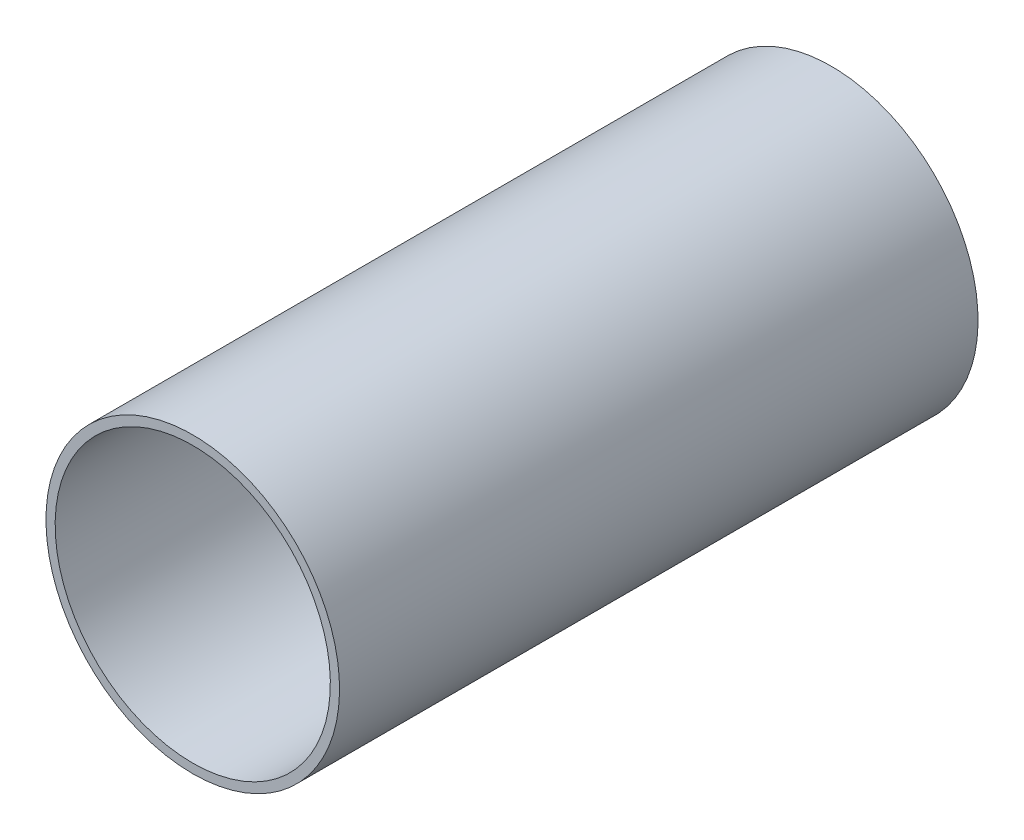
ISO-10303-21;
HEADER;
FILE_DESCRIPTION(('STEP AP214'),'2;1');
FILE_NAME('part.step','',(''),(''),'','','');
FILE_SCHEMA(('AUTOMOTIVE_DESIGN { 1 0 10303 214 1 1 1 1 }'));
ENDSEC;
DATA;
#1=APPLICATION_CONTEXT('core data for automotive mechanical design processes');
#2=APPLICATION_PROTOCOL_DEFINITION('international standard','automotive_design',2000,#1);
#3=PRODUCT_CONTEXT('',#1,'mechanical');
#4=PRODUCT('Part','Part','',(#3));
#5=PRODUCT_RELATED_PRODUCT_CATEGORY('part','',(#4));
#6=PRODUCT_DEFINITION_FORMATION('','',#4);
#7=PRODUCT_DEFINITION_CONTEXT('part definition',#1,'design');
#8=PRODUCT_DEFINITION('design','',#6,#7);
#9=PRODUCT_DEFINITION_SHAPE('','',#8);
#10=(LENGTH_UNIT() NAMED_UNIT(*) SI_UNIT(.MILLI.,.METRE.));
#11=(NAMED_UNIT(*) PLANE_ANGLE_UNIT() SI_UNIT($,.RADIAN.));
#12=(NAMED_UNIT(*) SI_UNIT($,.STERADIAN.) SOLID_ANGLE_UNIT());
#13=UNCERTAINTY_MEASURE_WITH_UNIT(LENGTH_MEASURE(1.E-05),#10,'distance_accuracy_value','');
#14=(GEOMETRIC_REPRESENTATION_CONTEXT(3) GLOBAL_UNCERTAINTY_ASSIGNED_CONTEXT((#13)) GLOBAL_UNIT_ASSIGNED_CONTEXT((#10,
#11,#12)) REPRESENTATION_CONTEXT('',''));
#15=CARTESIAN_POINT('',(0.,0.,0.));
#16=DIRECTION('',(0.,0.,1.));
#17=DIRECTION('',(1.,0.,0.));
#18=AXIS2_PLACEMENT_3D('',#15,#16,#17);
#19=CARTESIAN_POINT('',(142.24,-80.772,-0.045));
#20=DIRECTION('',(0.,0.,-1.));
#21=DIRECTION('',(0.,-1.,0.));
#22=AXIS2_PLACEMENT_3D('',#19,#20,#21);
#23=CYLINDRICAL_SURFACE('',#22,0.375);
#24=CARTESIAN_POINT('',(142.24,-80.772,-0.035));
#25=DIRECTION('',(0.,0.,-1.));
#26=DIRECTION('',(0.,-1.,0.));
#27=AXIS2_PLACEMENT_3D('',#24,#25,#26);
#28=CIRCLE('',#27,0.375);
#29=CARTESIAN_POINT('',(142.24,-81.147,-0.035));
#30=VERTEX_POINT('',#29);
#31=EDGE_CURVE('E65',#30,#30,#28,.T.);
#32=ORIENTED_EDGE('',*,*,#31,.T.);
#33=DIRECTION('',(0.,0.,1.));
#34=VECTOR('',#33,1.);
#35=CARTESIAN_POINT('',(142.24,-81.147,-0.045));
#36=LINE('',#35,#34);
#37=CARTESIAN_POINT('',(142.24,-81.147,1.705));
#38=VERTEX_POINT('',#37);
#39=EDGE_CURVE('E11',#30,#38,#36,.T.);
#40=ORIENTED_EDGE('',*,*,#39,.T.);
#41=CARTESIAN_POINT('',(142.24,-80.772,1.705));
#42=DIRECTION('',(0.,0.,-1.));
#43=DIRECTION('',(0.,-1.,0.));
#44=AXIS2_PLACEMENT_3D('',#41,#42,#43);
#45=CIRCLE('',#44,0.375);
#46=EDGE_CURVE('E26',#38,#38,#45,.T.);
#47=ORIENTED_EDGE('',*,*,#46,.F.);
#48=ORIENTED_EDGE('',*,*,#39,.F.);
#49=EDGE_LOOP('',(#32,#40,#47,#48));
#50=FACE_BOUND('',#49,.T.);
#51=ADVANCED_FACE('F17',(#50),#23,.F.);
#52=CARTESIAN_POINT('',(142.24,-81.172,1.705));
#53=DIRECTION('',(0.,0.,1.));
#54=DIRECTION('',(1.,0.,0.));
#55=AXIS2_PLACEMENT_3D('',#52,#53,#54);
#56=PLANE('',#55);
#57=ORIENTED_EDGE('',*,*,#46,.T.);
#58=EDGE_LOOP('',(#57));
#59=FACE_BOUND('',#58,.T.);
#60=CARTESIAN_POINT('',(142.24,-80.772,1.705));
#61=DIRECTION('',(0.,0.,1.));
#62=DIRECTION('',(0.,-1.,0.));
#63=AXIS2_PLACEMENT_3D('',#60,#61,#62);
#64=CIRCLE('',#63,0.4);
#65=CARTESIAN_POINT('',(142.24,-81.172,1.705));
#66=VERTEX_POINT('',#65);
#67=EDGE_CURVE('E57',#66,#66,#64,.T.);
#68=ORIENTED_EDGE('',*,*,#67,.T.);
#69=EDGE_LOOP('',(#68));
#70=FACE_BOUND('',#69,.T.);
#71=ADVANCED_FACE('F19',(#59,#70),#56,.T.);
#72=CARTESIAN_POINT('',(142.24,-81.172,-0.035));
#73=DIRECTION('',(0.,0.,1.));
#74=DIRECTION('',(1.,0.,0.));
#75=AXIS2_PLACEMENT_3D('',#72,#73,#74);
#76=PLANE('',#75);
#77=ORIENTED_EDGE('',*,*,#31,.F.);
#78=EDGE_LOOP('',(#77));
#79=FACE_BOUND('',#78,.T.);
#80=CARTESIAN_POINT('',(142.24,-80.772,-0.035));
#81=DIRECTION('',(0.,0.,1.));
#82=DIRECTION('',(0.,-1.,0.));
#83=AXIS2_PLACEMENT_3D('',#80,#81,#82);
#84=CIRCLE('',#83,0.4);
#85=CARTESIAN_POINT('',(142.24,-81.172,-0.035));
#86=VERTEX_POINT('',#85);
#87=EDGE_CURVE('E56',#86,#86,#84,.T.);
#88=ORIENTED_EDGE('',*,*,#87,.F.);
#89=EDGE_LOOP('',(#88));
#90=FACE_BOUND('',#89,.T.);
#91=ADVANCED_FACE('F83',(#79,#90),#76,.F.);
#92=CARTESIAN_POINT('',(142.24,-80.772,-0.035));
#93=DIRECTION('',(0.,0.,-1.));
#94=DIRECTION('',(0.,-1.,0.));
#95=AXIS2_PLACEMENT_3D('',#92,#93,#94);
#96=CYLINDRICAL_SURFACE('',#95,0.4);
#97=ORIENTED_EDGE('',*,*,#87,.T.);
#98=DIRECTION('',(0.,0.,1.));
#99=VECTOR('',#98,1.);
#100=CARTESIAN_POINT('',(142.24,-81.172,-0.035));
#101=LINE('',#100,#99);
#102=EDGE_CURVE('E53',#86,#66,#101,.T.);
#103=ORIENTED_EDGE('',*,*,#102,.T.);
#104=ORIENTED_EDGE('',*,*,#67,.F.);
#105=ORIENTED_EDGE('',*,*,#102,.F.);
#106=EDGE_LOOP('',(#97,#103,#104,#105));
#107=FACE_BOUND('',#106,.T.);
#108=ADVANCED_FACE('F54',(#107),#96,.T.);
#109=CLOSED_SHELL('',(#51,#71,#91,#108));
#110=MANIFOLD_SOLID_BREP('B1',#109);
#111=ADVANCED_BREP_SHAPE_REPRESENTATION('',(#18,#110),#14);
#112=SHAPE_DEFINITION_REPRESENTATION(#9,#111);
ENDSEC;
END-ISO-10303-21;
